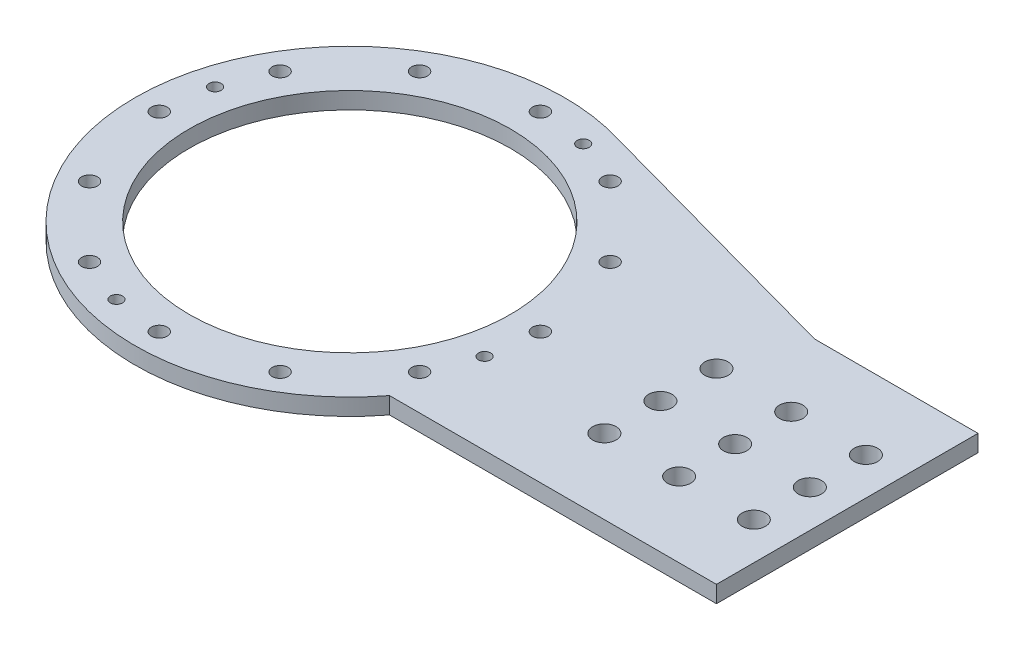
ISO-10303-21;
HEADER;
FILE_DESCRIPTION(('STEP AP214'),'2;1');
FILE_NAME('part.step','',(''),(''),'','','');
FILE_SCHEMA(('AUTOMOTIVE_DESIGN { 1 0 10303 214 1 1 1 1 }'));
ENDSEC;
DATA;
#1=APPLICATION_CONTEXT('core data for automotive mechanical design processes');
#2=APPLICATION_PROTOCOL_DEFINITION('international standard','automotive_design',2000,#1);
#3=PRODUCT_CONTEXT('',#1,'mechanical');
#4=PRODUCT('Part','Part','',(#3));
#5=PRODUCT_RELATED_PRODUCT_CATEGORY('part','',(#4));
#6=PRODUCT_DEFINITION_FORMATION('','',#4);
#7=PRODUCT_DEFINITION_CONTEXT('part definition',#1,'design');
#8=PRODUCT_DEFINITION('design','',#6,#7);
#9=PRODUCT_DEFINITION_SHAPE('','',#8);
#10=(LENGTH_UNIT() NAMED_UNIT(*) SI_UNIT(.MILLI.,.METRE.));
#11=(NAMED_UNIT(*) PLANE_ANGLE_UNIT() SI_UNIT($,.RADIAN.));
#12=(NAMED_UNIT(*) SI_UNIT($,.STERADIAN.) SOLID_ANGLE_UNIT());
#13=UNCERTAINTY_MEASURE_WITH_UNIT(LENGTH_MEASURE(1.E-05),#10,'distance_accuracy_value','');
#14=(GEOMETRIC_REPRESENTATION_CONTEXT(3) GLOBAL_UNCERTAINTY_ASSIGNED_CONTEXT((#13)) GLOBAL_UNIT_ASSIGNED_CONTEXT((#10,
#11,#12)) REPRESENTATION_CONTEXT('',''));
#15=CARTESIAN_POINT('',(0.,0.,0.));
#16=DIRECTION('',(0.,0.,1.));
#17=DIRECTION('',(1.,0.,0.));
#18=AXIS2_PLACEMENT_3D('',#15,#16,#17);
#19=CARTESIAN_POINT('',(83.1257980985413,-5.5,0.));
#20=DIRECTION('',(0.,1.,0.));
#21=DIRECTION('',(0.,0.,1.));
#22=AXIS2_PLACEMENT_3D('',#19,#20,#21);
#23=CYLINDRICAL_SURFACE('',#22,3.12500000000001);
#24=CARTESIAN_POINT('',(83.1257980985413,4.5,0.));
#25=DIRECTION('',(0.,1.,0.));
#26=DIRECTION('',(0.,0.,1.));
#27=AXIS2_PLACEMENT_3D('',#24,#25,#26);
#28=CIRCLE('',#27,3.12500000000001);
#29=CARTESIAN_POINT('',(83.1257980985413,4.5,3.12500000000001));
#30=VERTEX_POINT('',#29);
#31=EDGE_CURVE('E42',#30,#30,#28,.T.);
#32=ORIENTED_EDGE('',*,*,#31,.T.);
#33=EDGE_LOOP('',(#32));
#34=FACE_BOUND('',#33,.T.);
#35=CARTESIAN_POINT('',(83.1257980985413,0.,0.));
#36=DIRECTION('',(0.,1.,0.));
#37=DIRECTION('',(0.,0.,1.));
#38=AXIS2_PLACEMENT_3D('',#35,#36,#37);
#39=CIRCLE('',#38,3.12500000000001);
#40=CARTESIAN_POINT('',(83.1257980985413,0.,3.12500000000001));
#41=VERTEX_POINT('',#40);
#42=EDGE_CURVE('E11',#41,#41,#39,.T.);
#43=ORIENTED_EDGE('',*,*,#42,.F.);
#44=EDGE_LOOP('',(#43));
#45=FACE_BOUND('',#44,.T.);
#46=ADVANCED_FACE('F35',(#34,#45),#23,.F.);
#47=CARTESIAN_POINT('',(83.1257980985413,0.,15.));
#48=DIRECTION('',(0.,1.,0.));
#49=DIRECTION('',(0.,0.,1.));
#50=AXIS2_PLACEMENT_3D('',#47,#48,#49);
#51=CYLINDRICAL_SURFACE('',#50,3.125);
#52=CARTESIAN_POINT('',(83.1257980985413,0.,15.));
#53=DIRECTION('',(0.,1.,0.));
#54=DIRECTION('',(0.,0.,1.));
#55=AXIS2_PLACEMENT_3D('',#52,#53,#54);
#56=CIRCLE('',#55,3.125);
#57=CARTESIAN_POINT('',(83.1257980985413,0.,18.125));
#58=VERTEX_POINT('',#57);
#59=EDGE_CURVE('E122',#58,#58,#56,.T.);
#60=ORIENTED_EDGE('',*,*,#59,.F.);
#61=EDGE_LOOP('',(#60));
#62=FACE_BOUND('',#61,.T.);
#63=CARTESIAN_POINT('',(83.1257980985413,4.5,15.));
#64=DIRECTION('',(0.,1.,0.));
#65=DIRECTION('',(0.,0.,1.));
#66=AXIS2_PLACEMENT_3D('',#63,#64,#65);
#67=CIRCLE('',#66,3.125);
#68=CARTESIAN_POINT('',(83.1257980985413,4.5,18.125));
#69=VERTEX_POINT('',#68);
#70=EDGE_CURVE('E125',#69,#69,#67,.T.);
#71=ORIENTED_EDGE('',*,*,#70,.T.);
#72=EDGE_LOOP('',(#71));
#73=FACE_BOUND('',#72,.T.);
#74=ADVANCED_FACE('F193',(#62,#73),#51,.F.);
#75=CARTESIAN_POINT('',(83.1257980985413,0.,-15.));
#76=DIRECTION('',(0.,1.,0.));
#77=DIRECTION('',(0.,0.,1.));
#78=AXIS2_PLACEMENT_3D('',#75,#76,#77);
#79=CYLINDRICAL_SURFACE('',#78,3.125);
#80=CARTESIAN_POINT('',(83.1257980985413,0.,-15.));
#81=DIRECTION('',(0.,1.,0.));
#82=DIRECTION('',(0.,0.,1.));
#83=AXIS2_PLACEMENT_3D('',#80,#81,#82);
#84=CIRCLE('',#83,3.125);
#85=CARTESIAN_POINT('',(83.1257980985413,0.,-11.875));
#86=VERTEX_POINT('',#85);
#87=EDGE_CURVE('E115',#86,#86,#84,.T.);
#88=ORIENTED_EDGE('',*,*,#87,.F.);
#89=EDGE_LOOP('',(#88));
#90=FACE_BOUND('',#89,.T.);
#91=CARTESIAN_POINT('',(83.1257980985413,4.5,-15.));
#92=DIRECTION('',(0.,1.,0.));
#93=DIRECTION('',(0.,0.,1.));
#94=AXIS2_PLACEMENT_3D('',#91,#92,#93);
#95=CIRCLE('',#94,3.125);
#96=CARTESIAN_POINT('',(83.1257980985413,4.5,-11.875));
#97=VERTEX_POINT('',#96);
#98=EDGE_CURVE('E119',#97,#97,#95,.T.);
#99=ORIENTED_EDGE('',*,*,#98,.T.);
#100=EDGE_LOOP('',(#99));
#101=FACE_BOUND('',#100,.T.);
#102=ADVANCED_FACE('F197',(#90,#101),#79,.F.);
#103=CARTESIAN_POINT('',(0.,4.5,0.));
#104=DIRECTION('',(0.,-1.,0.));
#105=DIRECTION('',(0.,0.,-1.));
#106=AXIS2_PLACEMENT_3D('',#103,#104,#105);
#107=CYLINDRICAL_SURFACE('',#106,57.5);
#108=DIRECTION('',(0.,-1.,0.));
#109=VECTOR('',#108,1.);
#110=CARTESIAN_POINT('',(45.6207189772367,4.5,35.));
#111=LINE('',#110,#109);
#112=CARTESIAN_POINT('',(45.6207189772367,4.5,35.));
#113=VERTEX_POINT('',#112);
#114=CARTESIAN_POINT('',(45.6207189772367,0.,35.));
#115=VERTEX_POINT('',#114);
#116=EDGE_CURVE('E105',#113,#115,#111,.T.);
#117=ORIENTED_EDGE('',*,*,#116,.F.);
#118=CARTESIAN_POINT('',(0.,4.5,0.));
#119=DIRECTION('',(0.,1.,0.));
#120=DIRECTION('',(0.,0.,1.));
#121=AXIS2_PLACEMENT_3D('',#118,#119,#120);
#122=CIRCLE('',#121,57.5);
#123=CARTESIAN_POINT('',(16.7622892234834,4.5,-55.002505942805));
#124=VERTEX_POINT('',#123);
#125=EDGE_CURVE('E49',#124,#113,#122,.T.);
#126=ORIENTED_EDGE('',*,*,#125,.F.);
#127=DIRECTION('',(0.,-1.,0.));
#128=VECTOR('',#127,1.);
#129=CARTESIAN_POINT('',(16.7622892234842,4.5,-55.0025059428047));
#130=LINE('',#129,#128);
#131=CARTESIAN_POINT('',(16.7622892234834,0.,-55.002505942805));
#132=VERTEX_POINT('',#131);
#133=EDGE_CURVE('E53',#132,#124,#130,.F.);
#134=ORIENTED_EDGE('',*,*,#133,.F.);
#135=CARTESIAN_POINT('',(0.,0.,0.));
#136=DIRECTION('',(0.,1.,0.));
#137=DIRECTION('',(0.,0.,1.));
#138=AXIS2_PLACEMENT_3D('',#135,#136,#137);
#139=CIRCLE('',#138,57.5);
#140=EDGE_CURVE('E109',#132,#115,#139,.T.);
#141=ORIENTED_EDGE('',*,*,#140,.T.);
#142=EDGE_LOOP('',(#117,#126,#134,#141));
#143=FACE_BOUND('',#142,.T.);
#144=ADVANCED_FACE('F187',(#143),#107,.T.);
#145=CARTESIAN_POINT('',(133.125798098541,4.5,-35.));
#146=DIRECTION('',(0.,0.,1.));
#147=DIRECTION('',(1.,0.,0.));
#148=AXIS2_PLACEMENT_3D('',#145,#146,#147);
#149=PLANE('',#148);
#150=DIRECTION('',(0.,-1.,0.));
#151=VECTOR('',#150,1.);
#152=CARTESIAN_POINT('',(89.373258537889,4.5,-35.));
#153=LINE('',#152,#151);
#154=CARTESIAN_POINT('',(89.373258537889,4.5,-35.));
#155=VERTEX_POINT('',#154);
#156=CARTESIAN_POINT('',(89.373258537889,0.,-35.));
#157=VERTEX_POINT('',#156);
#158=EDGE_CURVE('E86',#155,#157,#153,.T.);
#159=ORIENTED_EDGE('',*,*,#158,.F.);
#160=DIRECTION('',(-1.,0.,0.));
#161=VECTOR('',#160,1.);
#162=CARTESIAN_POINT('',(133.125798098541,4.5,-35.));
#163=LINE('',#162,#161);
#164=CARTESIAN_POINT('',(133.125798098541,4.5,-35.));
#165=VERTEX_POINT('',#164);
#166=EDGE_CURVE('E79',#165,#155,#163,.T.);
#167=ORIENTED_EDGE('',*,*,#166,.F.);
#168=DIRECTION('',(0.,-1.,0.));
#169=VECTOR('',#168,1.);
#170=CARTESIAN_POINT('',(133.125798098541,4.5,-35.));
#171=LINE('',#170,#169);
#172=CARTESIAN_POINT('',(133.125798098541,0.,-35.));
#173=VERTEX_POINT('',#172);
#174=EDGE_CURVE('E83',#165,#173,#171,.T.);
#175=ORIENTED_EDGE('',*,*,#174,.T.);
#176=DIRECTION('',(-1.,0.,0.));
#177=VECTOR('',#176,1.);
#178=CARTESIAN_POINT('',(133.125798098541,0.,-35.));
#179=LINE('',#178,#177);
#180=EDGE_CURVE('E215',#173,#157,#179,.T.);
#181=ORIENTED_EDGE('',*,*,#180,.T.);
#182=EDGE_LOOP('',(#159,#167,#175,#181));
#183=FACE_BOUND('',#182,.T.);
#184=ADVANCED_FACE('F81',(#183),#149,.F.);
#185=CARTESIAN_POINT('',(0.,4.5,0.));
#186=DIRECTION('',(0.,1.,0.));
#187=DIRECTION('',(0.,0.,1.));
#188=AXIS2_PLACEMENT_3D('',#185,#186,#187);
#189=PLANE('',#188);
#190=CARTESIAN_POINT('',(103.125798098541,4.5,0.));
#191=DIRECTION('',(0.,1.,0.));
#192=DIRECTION('',(0.,0.,1.));
#193=AXIS2_PLACEMENT_3D('',#190,#191,#192);
#194=CIRCLE('',#193,3.12500000000001);
#195=CARTESIAN_POINT('',(103.125798098541,4.5,3.12500000000001));
#196=VERTEX_POINT('',#195);
#197=EDGE_CURVE('E320',#196,#196,#194,.T.);
#198=ORIENTED_EDGE('',*,*,#197,.F.);
#199=EDGE_LOOP('',(#198));
#200=FACE_BOUND('',#199,.T.);
#201=CARTESIAN_POINT('',(123.125798098541,4.5,0.));
#202=DIRECTION('',(0.,1.,0.));
#203=DIRECTION('',(0.,0.,1.));
#204=AXIS2_PLACEMENT_3D('',#201,#202,#203);
#205=CIRCLE('',#204,3.12500000000001);
#206=CARTESIAN_POINT('',(123.125798098541,4.5,3.12500000000001));
#207=VERTEX_POINT('',#206);
#208=EDGE_CURVE('E170',#207,#207,#205,.T.);
#209=ORIENTED_EDGE('',*,*,#208,.F.);
#210=EDGE_LOOP('',(#209));
#211=FACE_BOUND('',#210,.T.);
#212=CARTESIAN_POINT('',(-13.1997713002284,4.5,49.2622171407425));
#213=DIRECTION('',(0.,1.,0.));
#214=DIRECTION('',(1.,0.,0.));
#215=AXIS2_PLACEMENT_3D('',#212,#213,#214);
#216=CIRCLE('',#215,1.625);
#217=CARTESIAN_POINT('',(-11.5747713002284,4.5,49.2622171407425));
#218=VERTEX_POINT('',#217);
#219=EDGE_CURVE('E310',#218,#218,#216,.T.);
#220=ORIENTED_EDGE('',*,*,#219,.F.);
#221=EDGE_LOOP('',(#220));
#222=FACE_BOUND('',#221,.T.);
#223=CARTESIAN_POINT('',(49.2622171407425,4.5,13.1997713002286));
#224=DIRECTION('',(0.,1.,0.));
#225=DIRECTION('',(0.,0.,-1.));
#226=AXIS2_PLACEMENT_3D('',#223,#224,#225);
#227=CIRCLE('',#226,1.625);
#228=CARTESIAN_POINT('',(49.2622171407425,4.5,11.5747713002286));
#229=VERTEX_POINT('',#228);
#230=EDGE_CURVE('E304',#229,#229,#227,.T.);
#231=ORIENTED_EDGE('',*,*,#230,.F.);
#232=EDGE_LOOP('',(#231));
#233=FACE_BOUND('',#232,.T.);
#234=CARTESIAN_POINT('',(13.1997713002281,4.5,-49.2622171407426));
#235=DIRECTION('',(0.,1.,0.));
#236=DIRECTION('',(-1.,0.,0.));
#237=AXIS2_PLACEMENT_3D('',#234,#235,#236);
#238=CIRCLE('',#237,1.625);
#239=CARTESIAN_POINT('',(11.5747713002281,4.5,-49.2622171407426));
#240=VERTEX_POINT('',#239);
#241=EDGE_CURVE('E169',#240,#240,#238,.T.);
#242=ORIENTED_EDGE('',*,*,#241,.F.);
#243=EDGE_LOOP('',(#242));
#244=FACE_BOUND('',#243,.T.);
#245=CARTESIAN_POINT('',(-49.2622171407425,4.5,-13.1997713002286));
#246=DIRECTION('',(0.,1.,0.));
#247=DIRECTION('',(0.,0.,1.));
#248=AXIS2_PLACEMENT_3D('',#245,#246,#247);
#249=CIRCLE('',#248,1.625);
#250=CARTESIAN_POINT('',(-49.2622171407425,4.5,-11.5747713002286));
#251=VERTEX_POINT('',#250);
#252=EDGE_CURVE('E293',#251,#251,#249,.T.);
#253=ORIENTED_EDGE('',*,*,#252,.F.);
#254=EDGE_LOOP('',(#253));
#255=FACE_BOUND('',#254,.T.);
#256=CARTESIAN_POINT('',(-25.4999999999999,4.5,44.1672955930064));
#257=DIRECTION('',(0.,1.,0.));
#258=DIRECTION('',(0.86602540378444,0.,0.499999999999998));
#259=AXIS2_PLACEMENT_3D('',#256,#257,#258);
#260=CIRCLE('',#259,2.125);
#261=CARTESIAN_POINT('',(-23.659696016958,4.5,45.2297955930064));
#262=VERTEX_POINT('',#261);
#263=EDGE_CURVE('E262',#262,#262,#260,.T.);
#264=ORIENTED_EDGE('',*,*,#263,.F.);
#265=EDGE_LOOP('',(#264));
#266=FACE_BOUND('',#265,.T.);
#267=CARTESIAN_POINT('',(1.78065548281E-13,4.5,51.));
#268=DIRECTION('',(0.,1.,0.));
#269=DIRECTION('',(1.,0.,0.));
#270=AXIS2_PLACEMENT_3D('',#267,#268,#269);
#271=CIRCLE('',#270,2.125);
#272=CARTESIAN_POINT('',(2.12500000000018,4.5,51.));
#273=VERTEX_POINT('',#272);
#274=EDGE_CURVE('E282',#273,#273,#271,.T.);
#275=ORIENTED_EDGE('',*,*,#274,.F.);
#276=EDGE_LOOP('',(#275));
#277=FACE_BOUND('',#276,.T.);
#278=CARTESIAN_POINT('',(25.5000000000002,4.5,44.1672955930063));
#279=DIRECTION('',(0.,1.,0.));
#280=DIRECTION('',(0.866025403784436,0.,-0.500000000000004));
#281=AXIS2_PLACEMENT_3D('',#278,#279,#280);
#282=CIRCLE('',#281,2.125);
#283=CARTESIAN_POINT('',(27.3403039830421,4.5,43.1047955930063));
#284=VERTEX_POINT('',#283);
#285=EDGE_CURVE('E279',#284,#284,#282,.T.);
#286=ORIENTED_EDGE('',*,*,#285,.F.);
#287=EDGE_LOOP('',(#286));
#288=FACE_BOUND('',#287,.T.);
#289=CARTESIAN_POINT('',(44.1672955930065,4.5,25.4999999999997));
#290=DIRECTION('',(0.,1.,0.));
#291=DIRECTION('',(0.499999999999995,0.,-0.866025403784442));
#292=AXIS2_PLACEMENT_3D('',#289,#290,#291);
#293=CIRCLE('',#292,2.125);
#294=CARTESIAN_POINT('',(45.2297955930065,4.5,23.6596960169578));
#295=VERTEX_POINT('',#294);
#296=EDGE_CURVE('E276',#295,#295,#293,.T.);
#297=ORIENTED_EDGE('',*,*,#296,.F.);
#298=EDGE_LOOP('',(#297));
#299=FACE_BOUND('',#298,.T.);
#300=CARTESIAN_POINT('',(51.,4.5,0.));
#301=DIRECTION('',(0.,1.,0.));
#302=DIRECTION('',(0.,0.,-1.));
#303=AXIS2_PLACEMENT_3D('',#300,#301,#302);
#304=CIRCLE('',#303,2.125);
#305=CARTESIAN_POINT('',(51.,4.5,-2.125));
#306=VERTEX_POINT('',#305);
#307=EDGE_CURVE('E273',#306,#306,#304,.T.);
#308=ORIENTED_EDGE('',*,*,#307,.F.);
#309=EDGE_LOOP('',(#308));
#310=FACE_BOUND('',#309,.T.);
#311=CARTESIAN_POINT('',(44.1672955930062,4.5,-25.5000000000004));
#312=DIRECTION('',(0.,1.,0.));
#313=DIRECTION('',(-0.500000000000007,0.,-0.866025403784435));
#314=AXIS2_PLACEMENT_3D('',#311,#312,#313);
#315=CIRCLE('',#314,2.125);
#316=CARTESIAN_POINT('',(43.1047955930061,4.5,-27.3403039830423));
#317=VERTEX_POINT('',#316);
#318=EDGE_CURVE('E270',#317,#317,#315,.T.);
#319=ORIENTED_EDGE('',*,*,#318,.F.);
#320=EDGE_LOOP('',(#319));
#321=FACE_BOUND('',#320,.T.);
#322=CARTESIAN_POINT('',(25.4999999999996,4.5,-44.1672955930066));
#323=DIRECTION('',(0.,1.,0.));
#324=DIRECTION('',(-0.866025403784443,0.,-0.499999999999992));
#325=AXIS2_PLACEMENT_3D('',#322,#323,#324);
#326=CIRCLE('',#325,2.125);
#327=CARTESIAN_POINT('',(23.6596960169576,4.5,-45.2297955930066));
#328=VERTEX_POINT('',#327);
#329=EDGE_CURVE('E266',#328,#328,#326,.T.);
#330=ORIENTED_EDGE('',*,*,#329,.F.);
#331=EDGE_LOOP('',(#330));
#332=FACE_BOUND('',#331,.T.);
#333=CARTESIAN_POINT('',(-5.34196644842999E-13,4.5,-51.));
#334=DIRECTION('',(0.,1.,0.));
#335=DIRECTION('',(-1.,0.,0.));
#336=AXIS2_PLACEMENT_3D('',#333,#334,#335);
#337=CIRCLE('',#336,2.125);
#338=CARTESIAN_POINT('',(-2.12500000000054,4.5,-51.));
#339=VERTEX_POINT('',#338);
#340=EDGE_CURVE('E263',#339,#339,#337,.T.);
#341=ORIENTED_EDGE('',*,*,#340,.F.);
#342=EDGE_LOOP('',(#341));
#343=FACE_BOUND('',#342,.T.);
#344=CARTESIAN_POINT('',(-25.5000000000005,4.5,-44.1672955930061));
#345=DIRECTION('',(0.,1.,0.));
#346=DIRECTION('',(-0.866025403784433,0.,0.50000000000001));
#347=AXIS2_PLACEMENT_3D('',#344,#345,#346);
#348=CIRCLE('',#347,2.125);
#349=CARTESIAN_POINT('',(-27.3403039830424,4.5,-43.104795593006));
#350=VERTEX_POINT('',#349);
#351=EDGE_CURVE('E267',#350,#350,#348,.T.);
#352=ORIENTED_EDGE('',*,*,#351,.F.);
#353=EDGE_LOOP('',(#352));
#354=FACE_BOUND('',#353,.T.);
#355=CARTESIAN_POINT('',(-44.1672955930067,4.5,-25.4999999999994));
#356=DIRECTION('',(0.,1.,0.));
#357=DIRECTION('',(-0.499999999999989,0.,0.866025403784445));
#358=AXIS2_PLACEMENT_3D('',#355,#356,#357);
#359=CIRCLE('',#358,2.125);
#360=CARTESIAN_POINT('',(-45.2297955930067,4.5,-23.6596960169575));
#361=VERTEX_POINT('',#360);
#362=EDGE_CURVE('E287',#361,#361,#359,.T.);
#363=ORIENTED_EDGE('',*,*,#362,.F.);
#364=EDGE_LOOP('',(#363));
#365=FACE_BOUND('',#364,.T.);
#366=CARTESIAN_POINT('',(-44.1672955930063,4.5,25.5));
#367=DIRECTION('',(0.,1.,0.));
#368=DIRECTION('',(0.500000000000001,0.,0.866025403784438));
#369=AXIS2_PLACEMENT_3D('',#366,#367,#368);
#370=CIRCLE('',#369,2.125);
#371=CARTESIAN_POINT('',(-43.1047955930063,4.5,27.340303983042));
#372=VERTEX_POINT('',#371);
#373=EDGE_CURVE('E137',#372,#372,#370,.T.);
#374=ORIENTED_EDGE('',*,*,#373,.F.);
#375=EDGE_LOOP('',(#374));
#376=FACE_BOUND('',#375,.T.);
#377=CARTESIAN_POINT('',(-51.,4.5,0.));
#378=DIRECTION('',(0.,1.,0.));
#379=DIRECTION('',(0.,0.,1.));
#380=AXIS2_PLACEMENT_3D('',#377,#378,#379);
#381=CIRCLE('',#380,2.125);
#382=CARTESIAN_POINT('',(-51.,4.5,2.125));
#383=VERTEX_POINT('',#382);
#384=EDGE_CURVE('E132',#383,#383,#381,.T.);
#385=ORIENTED_EDGE('',*,*,#384,.F.);
#386=EDGE_LOOP('',(#385));
#387=FACE_BOUND('',#386,.T.);
#388=CARTESIAN_POINT('',(103.125798098541,4.5,15.));
#389=DIRECTION('',(0.,1.,0.));
#390=DIRECTION('',(0.,0.,1.));
#391=AXIS2_PLACEMENT_3D('',#388,#389,#390);
#392=CIRCLE('',#391,3.125);
#393=CARTESIAN_POINT('',(103.125798098541,4.5,18.125));
#394=VERTEX_POINT('',#393);
#395=EDGE_CURVE('E253',#394,#394,#392,.T.);
#396=ORIENTED_EDGE('',*,*,#395,.F.);
#397=EDGE_LOOP('',(#396));
#398=FACE_BOUND('',#397,.T.);
#399=CARTESIAN_POINT('',(103.125798098541,4.5,-15.));
#400=DIRECTION('',(0.,1.,0.));
#401=DIRECTION('',(0.,0.,1.));
#402=AXIS2_PLACEMENT_3D('',#399,#400,#401);
#403=CIRCLE('',#402,3.125);
#404=CARTESIAN_POINT('',(103.125798098541,4.5,-11.875));
#405=VERTEX_POINT('',#404);
#406=EDGE_CURVE('E240',#405,#405,#403,.T.);
#407=ORIENTED_EDGE('',*,*,#406,.F.);
#408=EDGE_LOOP('',(#407));
#409=FACE_BOUND('',#408,.T.);
#410=CARTESIAN_POINT('',(123.125798098541,4.5,-15.));
#411=DIRECTION('',(0.,1.,0.));
#412=DIRECTION('',(0.,0.,1.));
#413=AXIS2_PLACEMENT_3D('',#410,#411,#412);
#414=CIRCLE('',#413,3.125);
#415=CARTESIAN_POINT('',(123.125798098541,4.5,-11.875));
#416=VERTEX_POINT('',#415);
#417=EDGE_CURVE('E243',#416,#416,#414,.T.);
#418=ORIENTED_EDGE('',*,*,#417,.F.);
#419=EDGE_LOOP('',(#418));
#420=FACE_BOUND('',#419,.T.);
#421=CARTESIAN_POINT('',(123.125798098541,4.5,15.));
#422=DIRECTION('',(0.,1.,0.));
#423=DIRECTION('',(0.,0.,1.));
#424=AXIS2_PLACEMENT_3D('',#421,#422,#423);
#425=CIRCLE('',#424,3.125);
#426=CARTESIAN_POINT('',(123.125798098541,4.5,18.125));
#427=VERTEX_POINT('',#426);
#428=EDGE_CURVE('E236',#427,#427,#425,.T.);
#429=ORIENTED_EDGE('',*,*,#428,.F.);
#430=EDGE_LOOP('',(#429));
#431=FACE_BOUND('',#430,.T.);
#432=CARTESIAN_POINT('',(0.,4.5,0.));
#433=DIRECTION('',(0.,1.,0.));
#434=DIRECTION('',(0.,0.,1.));
#435=AXIS2_PLACEMENT_3D('',#432,#433,#434);
#436=CIRCLE('',#435,43.);
#437=CARTESIAN_POINT('',(0.,4.5,43.));
#438=VERTEX_POINT('',#437);
#439=EDGE_CURVE('E230',#438,#438,#436,.T.);
#440=ORIENTED_EDGE('',*,*,#439,.F.);
#441=EDGE_LOOP('',(#440));
#442=FACE_BOUND('',#441,.T.);
#443=DIRECTION('',(-0.964088221769249,0.,-0.265582191883806));
#444=VECTOR('',#443,1.);
#445=CARTESIAN_POINT('',(89.373258537889,4.5,-35.));
#446=LINE('',#445,#444);
#447=EDGE_CURVE('E222',#155,#124,#446,.T.);
#448=ORIENTED_EDGE('',*,*,#447,.T.);
#449=ORIENTED_EDGE('',*,*,#125,.T.);
#450=DIRECTION('',(1.,0.,0.));
#451=VECTOR('',#450,1.);
#452=CARTESIAN_POINT('',(133.125798098541,4.5,35.));
#453=LINE('',#452,#451);
#454=CARTESIAN_POINT('',(133.125798098541,4.5,35.));
#455=VERTEX_POINT('',#454);
#456=EDGE_CURVE('E90',#113,#455,#453,.T.);
#457=ORIENTED_EDGE('',*,*,#456,.T.);
#458=DIRECTION('',(0.,0.,-1.));
#459=VECTOR('',#458,1.);
#460=CARTESIAN_POINT('',(133.125798098541,4.5,-35.));
#461=LINE('',#460,#459);
#462=EDGE_CURVE('E91',#455,#165,#461,.T.);
#463=ORIENTED_EDGE('',*,*,#462,.T.);
#464=ORIENTED_EDGE('',*,*,#166,.T.);
#465=EDGE_LOOP('',(#448,#449,#457,#463,#464));
#466=FACE_BOUND('',#465,.T.);
#467=ORIENTED_EDGE('',*,*,#98,.F.);
#468=EDGE_LOOP('',(#467));
#469=FACE_BOUND('',#468,.T.);
#470=ORIENTED_EDGE('',*,*,#70,.F.);
#471=EDGE_LOOP('',(#470));
#472=FACE_BOUND('',#471,.T.);
#473=ORIENTED_EDGE('',*,*,#31,.F.);
#474=EDGE_LOOP('',(#473));
#475=FACE_BOUND('',#474,.T.);
#476=ADVANCED_FACE('F94',(#200,#211,#222,#233,#244,#255,#266,#277,#288,#299,#310,#321,#332,#343,
#354,#365,#376,#387,#398,#409,#420,#431,#442,#466,#469,#472,#475),#189,.T.);
#477=CARTESIAN_POINT('',(0.,0.,0.));
#478=DIRECTION('',(0.,1.,0.));
#479=DIRECTION('',(0.,0.,1.));
#480=AXIS2_PLACEMENT_3D('',#477,#478,#479);
#481=PLANE('',#480);
#482=CARTESIAN_POINT('',(103.125798098541,0.,0.));
#483=DIRECTION('',(0.,1.,0.));
#484=DIRECTION('',(0.,0.,1.));
#485=AXIS2_PLACEMENT_3D('',#482,#483,#484);
#486=CIRCLE('',#485,3.12500000000001);
#487=CARTESIAN_POINT('',(103.125798098541,0.,3.12500000000001));
#488=VERTEX_POINT('',#487);
#489=EDGE_CURVE('E317',#488,#488,#486,.T.);
#490=ORIENTED_EDGE('',*,*,#489,.T.);
#491=EDGE_LOOP('',(#490));
#492=FACE_BOUND('',#491,.T.);
#493=CARTESIAN_POINT('',(123.125798098541,0.,0.));
#494=DIRECTION('',(0.,1.,0.));
#495=DIRECTION('',(0.,0.,1.));
#496=AXIS2_PLACEMENT_3D('',#493,#494,#495);
#497=CIRCLE('',#496,3.12500000000001);
#498=CARTESIAN_POINT('',(123.125798098541,0.,3.12500000000001));
#499=VERTEX_POINT('',#498);
#500=EDGE_CURVE('E167',#499,#499,#497,.T.);
#501=ORIENTED_EDGE('',*,*,#500,.T.);
#502=EDGE_LOOP('',(#501));
#503=FACE_BOUND('',#502,.T.);
#504=CARTESIAN_POINT('',(-13.1997713002284,0.,49.2622171407425));
#505=DIRECTION('',(0.,1.,0.));
#506=DIRECTION('',(1.,0.,0.));
#507=AXIS2_PLACEMENT_3D('',#504,#505,#506);
#508=CIRCLE('',#507,1.625);
#509=CARTESIAN_POINT('',(-11.5747713002284,0.,49.2622171407425));
#510=VERTEX_POINT('',#509);
#511=EDGE_CURVE('E296',#510,#510,#508,.T.);
#512=ORIENTED_EDGE('',*,*,#511,.T.);
#513=EDGE_LOOP('',(#512));
#514=FACE_BOUND('',#513,.T.);
#515=CARTESIAN_POINT('',(49.2622171407425,0.,13.1997713002286));
#516=DIRECTION('',(0.,1.,0.));
#517=DIRECTION('',(0.,0.,-1.));
#518=AXIS2_PLACEMENT_3D('',#515,#516,#517);
#519=CIRCLE('',#518,1.625);
#520=CARTESIAN_POINT('',(49.2622171407425,0.,11.5747713002286));
#521=VERTEX_POINT('',#520);
#522=EDGE_CURVE('E307',#521,#521,#519,.T.);
#523=ORIENTED_EDGE('',*,*,#522,.T.);
#524=EDGE_LOOP('',(#523));
#525=FACE_BOUND('',#524,.T.);
#526=CARTESIAN_POINT('',(13.1997713002281,0.,-49.2622171407426));
#527=DIRECTION('',(0.,1.,0.));
#528=DIRECTION('',(-1.,0.,0.));
#529=AXIS2_PLACEMENT_3D('',#526,#527,#528);
#530=CIRCLE('',#529,1.625);
#531=CARTESIAN_POINT('',(11.5747713002281,0.,-49.2622171407426));
#532=VERTEX_POINT('',#531);
#533=EDGE_CURVE('E301',#532,#532,#530,.T.);
#534=ORIENTED_EDGE('',*,*,#533,.T.);
#535=EDGE_LOOP('',(#534));
#536=FACE_BOUND('',#535,.T.);
#537=CARTESIAN_POINT('',(-49.2622171407425,0.,-13.1997713002286));
#538=DIRECTION('',(0.,1.,0.));
#539=DIRECTION('',(0.,0.,1.));
#540=AXIS2_PLACEMENT_3D('',#537,#538,#539);
#541=CIRCLE('',#540,1.625);
#542=CARTESIAN_POINT('',(-49.2622171407425,0.,-11.5747713002286));
#543=VERTEX_POINT('',#542);
#544=EDGE_CURVE('E290',#543,#543,#541,.T.);
#545=ORIENTED_EDGE('',*,*,#544,.T.);
#546=EDGE_LOOP('',(#545));
#547=FACE_BOUND('',#546,.T.);
#548=CARTESIAN_POINT('',(-25.4999999999999,0.,44.1672955930064));
#549=DIRECTION('',(0.,1.,0.));
#550=DIRECTION('',(0.,0.,1.));
#551=AXIS2_PLACEMENT_3D('',#548,#549,#550);
#552=CIRCLE('',#551,2.125);
#553=CARTESIAN_POINT('',(-25.4999999999999,0.,46.2922955930064));
#554=VERTEX_POINT('',#553);
#555=EDGE_CURVE('E164',#554,#554,#552,.T.);
#556=ORIENTED_EDGE('',*,*,#555,.T.);
#557=EDGE_LOOP('',(#556));
#558=FACE_BOUND('',#557,.T.);
#559=CARTESIAN_POINT('',(1.78065548281E-13,0.,51.));
#560=DIRECTION('',(0.,1.,0.));
#561=DIRECTION('',(0.,0.,1.));
#562=AXIS2_PLACEMENT_3D('',#559,#560,#561);
#563=CIRCLE('',#562,2.125);
#564=CARTESIAN_POINT('',(1.78065548281E-13,0.,53.125));
#565=VERTEX_POINT('',#564);
#566=EDGE_CURVE('E161',#565,#565,#563,.T.);
#567=ORIENTED_EDGE('',*,*,#566,.T.);
#568=EDGE_LOOP('',(#567));
#569=FACE_BOUND('',#568,.T.);
#570=CARTESIAN_POINT('',(25.5000000000002,0.,44.1672955930063));
#571=DIRECTION('',(0.,1.,0.));
#572=DIRECTION('',(0.,0.,1.));
#573=AXIS2_PLACEMENT_3D('',#570,#571,#572);
#574=CIRCLE('',#573,2.125);
#575=CARTESIAN_POINT('',(25.5000000000002,0.,46.2922955930063));
#576=VERTEX_POINT('',#575);
#577=EDGE_CURVE('E158',#576,#576,#574,.T.);
#578=ORIENTED_EDGE('',*,*,#577,.T.);
#579=EDGE_LOOP('',(#578));
#580=FACE_BOUND('',#579,.T.);
#581=CARTESIAN_POINT('',(44.1672955930065,0.,25.4999999999997));
#582=DIRECTION('',(0.,1.,0.));
#583=DIRECTION('',(0.,0.,1.));
#584=AXIS2_PLACEMENT_3D('',#581,#582,#583);
#585=CIRCLE('',#584,2.125);
#586=CARTESIAN_POINT('',(44.1672955930065,0.,27.6249999999997));
#587=VERTEX_POINT('',#586);
#588=EDGE_CURVE('E155',#587,#587,#585,.T.);
#589=ORIENTED_EDGE('',*,*,#588,.T.);
#590=EDGE_LOOP('',(#589));
#591=FACE_BOUND('',#590,.T.);
#592=CARTESIAN_POINT('',(51.,0.,0.));
#593=DIRECTION('',(0.,1.,0.));
#594=DIRECTION('',(0.,0.,1.));
#595=AXIS2_PLACEMENT_3D('',#592,#593,#594);
#596=CIRCLE('',#595,2.125);
#597=CARTESIAN_POINT('',(51.,0.,2.125));
#598=VERTEX_POINT('',#597);
#599=EDGE_CURVE('E152',#598,#598,#596,.T.);
#600=ORIENTED_EDGE('',*,*,#599,.T.);
#601=EDGE_LOOP('',(#600));
#602=FACE_BOUND('',#601,.T.);
#603=CARTESIAN_POINT('',(44.1672955930062,0.,-25.5000000000004));
#604=DIRECTION('',(0.,1.,0.));
#605=DIRECTION('',(0.,0.,1.));
#606=AXIS2_PLACEMENT_3D('',#603,#604,#605);
#607=CIRCLE('',#606,2.125);
#608=CARTESIAN_POINT('',(44.1672955930062,0.,-23.3750000000004));
#609=VERTEX_POINT('',#608);
#610=EDGE_CURVE('E149',#609,#609,#607,.T.);
#611=ORIENTED_EDGE('',*,*,#610,.T.);
#612=EDGE_LOOP('',(#611));
#613=FACE_BOUND('',#612,.T.);
#614=CARTESIAN_POINT('',(25.4999999999996,0.,-44.1672955930066));
#615=DIRECTION('',(0.,1.,0.));
#616=DIRECTION('',(0.,0.,1.));
#617=AXIS2_PLACEMENT_3D('',#614,#615,#616);
#618=CIRCLE('',#617,2.125);
#619=CARTESIAN_POINT('',(25.4999999999996,0.,-42.0422955930066));
#620=VERTEX_POINT('',#619);
#621=EDGE_CURVE('E146',#620,#620,#618,.T.);
#622=ORIENTED_EDGE('',*,*,#621,.T.);
#623=EDGE_LOOP('',(#622));
#624=FACE_BOUND('',#623,.T.);
#625=CARTESIAN_POINT('',(-5.34196644842999E-13,0.,-51.));
#626=DIRECTION('',(0.,1.,0.));
#627=DIRECTION('',(0.,0.,1.));
#628=AXIS2_PLACEMENT_3D('',#625,#626,#627);
#629=CIRCLE('',#628,2.125);
#630=CARTESIAN_POINT('',(-5.34196644842999E-13,0.,-48.875));
#631=VERTEX_POINT('',#630);
#632=EDGE_CURVE('E143',#631,#631,#629,.T.);
#633=ORIENTED_EDGE('',*,*,#632,.T.);
#634=EDGE_LOOP('',(#633));
#635=FACE_BOUND('',#634,.T.);
#636=CARTESIAN_POINT('',(-25.5000000000005,0.,-44.1672955930061));
#637=DIRECTION('',(0.,1.,0.));
#638=DIRECTION('',(0.,0.,1.));
#639=AXIS2_PLACEMENT_3D('',#636,#637,#638);
#640=CIRCLE('',#639,2.125);
#641=CARTESIAN_POINT('',(-25.5000000000005,0.,-42.0422955930061));
#642=VERTEX_POINT('',#641);
#643=EDGE_CURVE('E140',#642,#642,#640,.T.);
#644=ORIENTED_EDGE('',*,*,#643,.T.);
#645=EDGE_LOOP('',(#644));
#646=FACE_BOUND('',#645,.T.);
#647=CARTESIAN_POINT('',(-44.1672955930067,0.,-25.4999999999994));
#648=DIRECTION('',(0.,1.,0.));
#649=DIRECTION('',(0.,0.,1.));
#650=AXIS2_PLACEMENT_3D('',#647,#648,#649);
#651=CIRCLE('',#650,2.125);
#652=CARTESIAN_POINT('',(-44.1672955930067,0.,-23.3749999999994));
#653=VERTEX_POINT('',#652);
#654=EDGE_CURVE('E136',#653,#653,#651,.T.);
#655=ORIENTED_EDGE('',*,*,#654,.T.);
#656=EDGE_LOOP('',(#655));
#657=FACE_BOUND('',#656,.T.);
#658=CARTESIAN_POINT('',(-44.1672955930063,0.,25.5));
#659=DIRECTION('',(0.,1.,0.));
#660=DIRECTION('',(0.,0.,1.));
#661=AXIS2_PLACEMENT_3D('',#658,#659,#660);
#662=CIRCLE('',#661,2.125);
#663=CARTESIAN_POINT('',(-44.1672955930063,0.,27.6250000000001));
#664=VERTEX_POINT('',#663);
#665=EDGE_CURVE('E133',#664,#664,#662,.T.);
#666=ORIENTED_EDGE('',*,*,#665,.T.);
#667=EDGE_LOOP('',(#666));
#668=FACE_BOUND('',#667,.T.);
#669=CARTESIAN_POINT('',(-51.,0.,0.));
#670=DIRECTION('',(0.,1.,0.));
#671=DIRECTION('',(0.,0.,1.));
#672=AXIS2_PLACEMENT_3D('',#669,#670,#671);
#673=CIRCLE('',#672,2.125);
#674=CARTESIAN_POINT('',(-51.,0.,2.125));
#675=VERTEX_POINT('',#674);
#676=EDGE_CURVE('E128',#675,#675,#673,.T.);
#677=ORIENTED_EDGE('',*,*,#676,.T.);
#678=EDGE_LOOP('',(#677));
#679=FACE_BOUND('',#678,.T.);
#680=CARTESIAN_POINT('',(103.125798098541,0.,15.));
#681=DIRECTION('',(0.,1.,0.));
#682=DIRECTION('',(0.,0.,1.));
#683=AXIS2_PLACEMENT_3D('',#680,#681,#682);
#684=CIRCLE('',#683,3.125);
#685=CARTESIAN_POINT('',(103.125798098541,0.,18.125));
#686=VERTEX_POINT('',#685);
#687=EDGE_CURVE('E131',#686,#686,#684,.T.);
#688=ORIENTED_EDGE('',*,*,#687,.T.);
#689=EDGE_LOOP('',(#688));
#690=FACE_BOUND('',#689,.T.);
#691=CARTESIAN_POINT('',(103.125798098541,0.,-15.));
#692=DIRECTION('',(0.,1.,0.));
#693=DIRECTION('',(0.,0.,1.));
#694=AXIS2_PLACEMENT_3D('',#691,#692,#693);
#695=CIRCLE('',#694,3.125);
#696=CARTESIAN_POINT('',(103.125798098541,0.,-11.875));
#697=VERTEX_POINT('',#696);
#698=EDGE_CURVE('E250',#697,#697,#695,.T.);
#699=ORIENTED_EDGE('',*,*,#698,.T.);
#700=EDGE_LOOP('',(#699));
#701=FACE_BOUND('',#700,.T.);
#702=CARTESIAN_POINT('',(123.125798098541,0.,-15.));
#703=DIRECTION('',(0.,1.,0.));
#704=DIRECTION('',(0.,0.,1.));
#705=AXIS2_PLACEMENT_3D('',#702,#703,#704);
#706=CIRCLE('',#705,3.125);
#707=CARTESIAN_POINT('',(123.125798098541,0.,-11.875));
#708=VERTEX_POINT('',#707);
#709=EDGE_CURVE('E233',#708,#708,#706,.T.);
#710=ORIENTED_EDGE('',*,*,#709,.T.);
#711=EDGE_LOOP('',(#710));
#712=FACE_BOUND('',#711,.T.);
#713=CARTESIAN_POINT('',(123.125798098541,0.,15.));
#714=DIRECTION('',(0.,1.,0.));
#715=DIRECTION('',(0.,0.,1.));
#716=AXIS2_PLACEMENT_3D('',#713,#714,#715);
#717=CIRCLE('',#716,3.125);
#718=CARTESIAN_POINT('',(123.125798098541,0.,18.125));
#719=VERTEX_POINT('',#718);
#720=EDGE_CURVE('E239',#719,#719,#717,.T.);
#721=ORIENTED_EDGE('',*,*,#720,.T.);
#722=EDGE_LOOP('',(#721));
#723=FACE_BOUND('',#722,.T.);
#724=CARTESIAN_POINT('',(0.,0.,0.));
#725=DIRECTION('',(0.,1.,0.));
#726=DIRECTION('',(0.,0.,1.));
#727=AXIS2_PLACEMENT_3D('',#724,#725,#726);
#728=CIRCLE('',#727,43.);
#729=CARTESIAN_POINT('',(0.,0.,43.));
#730=VERTEX_POINT('',#729);
#731=EDGE_CURVE('E223',#730,#730,#728,.T.);
#732=ORIENTED_EDGE('',*,*,#731,.T.);
#733=EDGE_LOOP('',(#732));
#734=FACE_BOUND('',#733,.T.);
#735=ORIENTED_EDGE('',*,*,#140,.F.);
#736=DIRECTION('',(-0.964088221769249,0.,-0.265582191883806));
#737=VECTOR('',#736,1.);
#738=CARTESIAN_POINT('',(89.373258537889,0.,-35.));
#739=LINE('',#738,#737);
#740=EDGE_CURVE('E220',#157,#132,#739,.T.);
#741=ORIENTED_EDGE('',*,*,#740,.F.);
#742=ORIENTED_EDGE('',*,*,#180,.F.);
#743=DIRECTION('',(0.,0.,-1.));
#744=VECTOR('',#743,1.);
#745=CARTESIAN_POINT('',(133.125798098541,0.,-35.));
#746=LINE('',#745,#744);
#747=CARTESIAN_POINT('',(133.125798098541,0.,35.));
#748=VERTEX_POINT('',#747);
#749=EDGE_CURVE('E104',#748,#173,#746,.T.);
#750=ORIENTED_EDGE('',*,*,#749,.F.);
#751=DIRECTION('',(1.,0.,0.));
#752=VECTOR('',#751,1.);
#753=CARTESIAN_POINT('',(133.125798098541,0.,35.));
#754=LINE('',#753,#752);
#755=EDGE_CURVE('E100',#115,#748,#754,.T.);
#756=ORIENTED_EDGE('',*,*,#755,.F.);
#757=EDGE_LOOP('',(#735,#741,#742,#750,#756));
#758=FACE_BOUND('',#757,.T.);
#759=ORIENTED_EDGE('',*,*,#87,.T.);
#760=EDGE_LOOP('',(#759));
#761=FACE_BOUND('',#760,.T.);
#762=ORIENTED_EDGE('',*,*,#59,.T.);
#763=EDGE_LOOP('',(#762));
#764=FACE_BOUND('',#763,.T.);
#765=ORIENTED_EDGE('',*,*,#42,.T.);
#766=EDGE_LOOP('',(#765));
#767=FACE_BOUND('',#766,.T.);
#768=ADVANCED_FACE('F177',(#492,#503,#514,#525,#536,#547,#558,#569,#580,#591,#602,#613,#624,
#635,#646,#657,#668,#679,#690,#701,#712,#723,#734,#758,#761,#764,#767),#481,.F.);
#769=CARTESIAN_POINT('',(133.125798098541,4.5,35.));
#770=DIRECTION('',(0.,0.,-1.));
#771=DIRECTION('',(-1.,0.,0.));
#772=AXIS2_PLACEMENT_3D('',#769,#770,#771);
#773=PLANE('',#772);
#774=ORIENTED_EDGE('',*,*,#456,.F.);
#775=ORIENTED_EDGE('',*,*,#116,.T.);
#776=ORIENTED_EDGE('',*,*,#755,.T.);
#777=DIRECTION('',(0.,-1.,0.));
#778=VECTOR('',#777,1.);
#779=CARTESIAN_POINT('',(133.125798098541,4.5,35.));
#780=LINE('',#779,#778);
#781=EDGE_CURVE('E106',#455,#748,#780,.T.);
#782=ORIENTED_EDGE('',*,*,#781,.F.);
#783=EDGE_LOOP('',(#774,#775,#776,#782));
#784=FACE_BOUND('',#783,.T.);
#785=ADVANCED_FACE('F184',(#784),#773,.F.);
#786=CARTESIAN_POINT('',(133.125798098541,4.5,-35.));
#787=DIRECTION('',(-1.,0.,0.));
#788=DIRECTION('',(0.,0.,1.));
#789=AXIS2_PLACEMENT_3D('',#786,#787,#788);
#790=PLANE('',#789);
#791=ORIENTED_EDGE('',*,*,#749,.T.);
#792=ORIENTED_EDGE('',*,*,#174,.F.);
#793=ORIENTED_EDGE('',*,*,#462,.F.);
#794=ORIENTED_EDGE('',*,*,#781,.T.);
#795=EDGE_LOOP('',(#791,#792,#793,#794));
#796=FACE_BOUND('',#795,.T.);
#797=ADVANCED_FACE('F102',(#796),#790,.F.);
#798=CARTESIAN_POINT('',(89.373258537889,4.5,-35.));
#799=DIRECTION('',(-0.265582191883806,0.,0.964088221769249));
#800=DIRECTION('',(0.964088221769249,0.,0.265582191883806));
#801=AXIS2_PLACEMENT_3D('',#798,#799,#800);
#802=PLANE('',#801);
#803=ORIENTED_EDGE('',*,*,#740,.T.);
#804=ORIENTED_EDGE('',*,*,#133,.T.);
#805=ORIENTED_EDGE('',*,*,#447,.F.);
#806=ORIENTED_EDGE('',*,*,#158,.T.);
#807=EDGE_LOOP('',(#803,#804,#805,#806));
#808=FACE_BOUND('',#807,.T.);
#809=ADVANCED_FACE('F225',(#808),#802,.F.);
#810=CARTESIAN_POINT('',(0.,0.,0.));
#811=DIRECTION('',(0.,1.,0.));
#812=DIRECTION('',(0.,0.,1.));
#813=AXIS2_PLACEMENT_3D('',#810,#811,#812);
#814=CYLINDRICAL_SURFACE('',#813,43.);
#815=ORIENTED_EDGE('',*,*,#731,.F.);
#816=EDGE_LOOP('',(#815));
#817=FACE_BOUND('',#816,.T.);
#818=ORIENTED_EDGE('',*,*,#439,.T.);
#819=EDGE_LOOP('',(#818));
#820=FACE_BOUND('',#819,.T.);
#821=ADVANCED_FACE('F374',(#817,#820),#814,.F.);
#822=CARTESIAN_POINT('',(123.125798098541,0.,15.));
#823=DIRECTION('',(0.,1.,0.));
#824=DIRECTION('',(0.,0.,1.));
#825=AXIS2_PLACEMENT_3D('',#822,#823,#824);
#826=CYLINDRICAL_SURFACE('',#825,3.125);
#827=ORIENTED_EDGE('',*,*,#720,.F.);
#828=EDGE_LOOP('',(#827));
#829=FACE_BOUND('',#828,.T.);
#830=ORIENTED_EDGE('',*,*,#428,.T.);
#831=EDGE_LOOP('',(#830));
#832=FACE_BOUND('',#831,.T.);
#833=ADVANCED_FACE('F377',(#829,#832),#826,.F.);
#834=CARTESIAN_POINT('',(123.125798098541,0.,-15.));
#835=DIRECTION('',(0.,1.,0.));
#836=DIRECTION('',(0.,0.,1.));
#837=AXIS2_PLACEMENT_3D('',#834,#835,#836);
#838=CYLINDRICAL_SURFACE('',#837,3.125);
#839=ORIENTED_EDGE('',*,*,#709,.F.);
#840=EDGE_LOOP('',(#839));
#841=FACE_BOUND('',#840,.T.);
#842=ORIENTED_EDGE('',*,*,#417,.T.);
#843=EDGE_LOOP('',(#842));
#844=FACE_BOUND('',#843,.T.);
#845=ADVANCED_FACE('F385',(#841,#844),#838,.F.);
#846=CARTESIAN_POINT('',(103.125798098541,0.,-15.));
#847=DIRECTION('',(0.,1.,0.));
#848=DIRECTION('',(0.,0.,1.));
#849=AXIS2_PLACEMENT_3D('',#846,#847,#848);
#850=CYLINDRICAL_SURFACE('',#849,3.125);
#851=ORIENTED_EDGE('',*,*,#698,.F.);
#852=EDGE_LOOP('',(#851));
#853=FACE_BOUND('',#852,.T.);
#854=ORIENTED_EDGE('',*,*,#406,.T.);
#855=EDGE_LOOP('',(#854));
#856=FACE_BOUND('',#855,.T.);
#857=ADVANCED_FACE('F423',(#853,#856),#850,.F.);
#858=CARTESIAN_POINT('',(103.125798098541,0.,15.));
#859=DIRECTION('',(0.,1.,0.));
#860=DIRECTION('',(0.,0.,1.));
#861=AXIS2_PLACEMENT_3D('',#858,#859,#860);
#862=CYLINDRICAL_SURFACE('',#861,3.125);
#863=ORIENTED_EDGE('',*,*,#687,.F.);
#864=EDGE_LOOP('',(#863));
#865=FACE_BOUND('',#864,.T.);
#866=ORIENTED_EDGE('',*,*,#395,.T.);
#867=EDGE_LOOP('',(#866));
#868=FACE_BOUND('',#867,.T.);
#869=ADVANCED_FACE('F443',(#865,#868),#862,.F.);
#870=CARTESIAN_POINT('',(-51.,-1.2E-05,0.));
#871=DIRECTION('',(0.,1.,0.));
#872=DIRECTION('',(0.,0.,1.));
#873=AXIS2_PLACEMENT_3D('',#870,#871,#872);
#874=CYLINDRICAL_SURFACE('',#873,2.125);
#875=ORIENTED_EDGE('',*,*,#384,.T.);
#876=EDGE_LOOP('',(#875));
#877=FACE_BOUND('',#876,.T.);
#878=ORIENTED_EDGE('',*,*,#676,.F.);
#879=EDGE_LOOP('',(#878));
#880=FACE_BOUND('',#879,.T.);
#881=ADVANCED_FACE('F453',(#877,#880),#874,.F.);
#882=CARTESIAN_POINT('',(-44.1672955930063,-1.2E-05,25.5));
#883=DIRECTION('',(0.,1.,0.));
#884=DIRECTION('',(0.,0.,1.));
#885=AXIS2_PLACEMENT_3D('',#882,#883,#884);
#886=CYLINDRICAL_SURFACE('',#885,2.125);
#887=ORIENTED_EDGE('',*,*,#373,.T.);
#888=EDGE_LOOP('',(#887));
#889=FACE_BOUND('',#888,.T.);
#890=ORIENTED_EDGE('',*,*,#665,.F.);
#891=EDGE_LOOP('',(#890));
#892=FACE_BOUND('',#891,.T.);
#893=ADVANCED_FACE('F463',(#889,#892),#886,.F.);
#894=CARTESIAN_POINT('',(-44.1672955930067,-1.2E-05,-25.4999999999994));
#895=DIRECTION('',(0.,1.,0.));
#896=DIRECTION('',(0.,0.,1.));
#897=AXIS2_PLACEMENT_3D('',#894,#895,#896);
#898=CYLINDRICAL_SURFACE('',#897,2.125);
#899=ORIENTED_EDGE('',*,*,#362,.T.);
#900=EDGE_LOOP('',(#899));
#901=FACE_BOUND('',#900,.T.);
#902=ORIENTED_EDGE('',*,*,#654,.F.);
#903=EDGE_LOOP('',(#902));
#904=FACE_BOUND('',#903,.T.);
#905=ADVANCED_FACE('F473',(#901,#904),#898,.F.);
#906=CARTESIAN_POINT('',(-25.5000000000005,-1.2E-05,-44.1672955930061));
#907=DIRECTION('',(0.,1.,0.));
#908=DIRECTION('',(0.,0.,1.));
#909=AXIS2_PLACEMENT_3D('',#906,#907,#908);
#910=CYLINDRICAL_SURFACE('',#909,2.125);
#911=ORIENTED_EDGE('',*,*,#351,.T.);
#912=EDGE_LOOP('',(#911));
#913=FACE_BOUND('',#912,.T.);
#914=ORIENTED_EDGE('',*,*,#643,.F.);
#915=EDGE_LOOP('',(#914));
#916=FACE_BOUND('',#915,.T.);
#917=ADVANCED_FACE('F483',(#913,#916),#910,.F.);
#918=CARTESIAN_POINT('',(-5.34196644842999E-13,-1.2E-05,-51.));
#919=DIRECTION('',(0.,1.,0.));
#920=DIRECTION('',(0.,0.,1.));
#921=AXIS2_PLACEMENT_3D('',#918,#919,#920);
#922=CYLINDRICAL_SURFACE('',#921,2.125);
#923=ORIENTED_EDGE('',*,*,#340,.T.);
#924=EDGE_LOOP('',(#923));
#925=FACE_BOUND('',#924,.T.);
#926=ORIENTED_EDGE('',*,*,#632,.F.);
#927=EDGE_LOOP('',(#926));
#928=FACE_BOUND('',#927,.T.);
#929=ADVANCED_FACE('F493',(#925,#928),#922,.F.);
#930=CARTESIAN_POINT('',(25.4999999999996,-1.2E-05,-44.1672955930066));
#931=DIRECTION('',(0.,1.,0.));
#932=DIRECTION('',(0.,0.,1.));
#933=AXIS2_PLACEMENT_3D('',#930,#931,#932);
#934=CYLINDRICAL_SURFACE('',#933,2.125);
#935=ORIENTED_EDGE('',*,*,#329,.T.);
#936=EDGE_LOOP('',(#935));
#937=FACE_BOUND('',#936,.T.);
#938=ORIENTED_EDGE('',*,*,#621,.F.);
#939=EDGE_LOOP('',(#938));
#940=FACE_BOUND('',#939,.T.);
#941=ADVANCED_FACE('F503',(#937,#940),#934,.F.);
#942=CARTESIAN_POINT('',(44.1672955930062,-1.2E-05,-25.5000000000004));
#943=DIRECTION('',(0.,1.,0.));
#944=DIRECTION('',(0.,0.,1.));
#945=AXIS2_PLACEMENT_3D('',#942,#943,#944);
#946=CYLINDRICAL_SURFACE('',#945,2.125);
#947=ORIENTED_EDGE('',*,*,#318,.T.);
#948=EDGE_LOOP('',(#947));
#949=FACE_BOUND('',#948,.T.);
#950=ORIENTED_EDGE('',*,*,#610,.F.);
#951=EDGE_LOOP('',(#950));
#952=FACE_BOUND('',#951,.T.);
#953=ADVANCED_FACE('F513',(#949,#952),#946,.F.);
#954=CARTESIAN_POINT('',(51.,-1.2E-05,0.));
#955=DIRECTION('',(0.,1.,0.));
#956=DIRECTION('',(0.,0.,1.));
#957=AXIS2_PLACEMENT_3D('',#954,#955,#956);
#958=CYLINDRICAL_SURFACE('',#957,2.125);
#959=ORIENTED_EDGE('',*,*,#307,.T.);
#960=EDGE_LOOP('',(#959));
#961=FACE_BOUND('',#960,.T.);
#962=ORIENTED_EDGE('',*,*,#599,.F.);
#963=EDGE_LOOP('',(#962));
#964=FACE_BOUND('',#963,.T.);
#965=ADVANCED_FACE('F523',(#961,#964),#958,.F.);
#966=CARTESIAN_POINT('',(44.1672955930065,-1.2E-05,25.4999999999997));
#967=DIRECTION('',(0.,1.,0.));
#968=DIRECTION('',(0.,0.,1.));
#969=AXIS2_PLACEMENT_3D('',#966,#967,#968);
#970=CYLINDRICAL_SURFACE('',#969,2.125);
#971=ORIENTED_EDGE('',*,*,#296,.T.);
#972=EDGE_LOOP('',(#971));
#973=FACE_BOUND('',#972,.T.);
#974=ORIENTED_EDGE('',*,*,#588,.F.);
#975=EDGE_LOOP('',(#974));
#976=FACE_BOUND('',#975,.T.);
#977=ADVANCED_FACE('F533',(#973,#976),#970,.F.);
#978=CARTESIAN_POINT('',(25.5000000000002,-1.2E-05,44.1672955930063));
#979=DIRECTION('',(0.,1.,0.));
#980=DIRECTION('',(0.,0.,1.));
#981=AXIS2_PLACEMENT_3D('',#978,#979,#980);
#982=CYLINDRICAL_SURFACE('',#981,2.125);
#983=ORIENTED_EDGE('',*,*,#285,.T.);
#984=EDGE_LOOP('',(#983));
#985=FACE_BOUND('',#984,.T.);
#986=ORIENTED_EDGE('',*,*,#577,.F.);
#987=EDGE_LOOP('',(#986));
#988=FACE_BOUND('',#987,.T.);
#989=ADVANCED_FACE('F543',(#985,#988),#982,.F.);
#990=CARTESIAN_POINT('',(1.78065548281E-13,-1.2E-05,51.));
#991=DIRECTION('',(0.,1.,0.));
#992=DIRECTION('',(0.,0.,1.));
#993=AXIS2_PLACEMENT_3D('',#990,#991,#992);
#994=CYLINDRICAL_SURFACE('',#993,2.125);
#995=ORIENTED_EDGE('',*,*,#274,.T.);
#996=EDGE_LOOP('',(#995));
#997=FACE_BOUND('',#996,.T.);
#998=ORIENTED_EDGE('',*,*,#566,.F.);
#999=EDGE_LOOP('',(#998));
#1000=FACE_BOUND('',#999,.T.);
#1001=ADVANCED_FACE('F553',(#997,#1000),#994,.F.);
#1002=CARTESIAN_POINT('',(-25.4999999999999,-1.2E-05,44.1672955930064));
#1003=DIRECTION('',(0.,1.,0.));
#1004=DIRECTION('',(0.,0.,1.));
#1005=AXIS2_PLACEMENT_3D('',#1002,#1003,#1004);
#1006=CYLINDRICAL_SURFACE('',#1005,2.125);
#1007=ORIENTED_EDGE('',*,*,#263,.T.);
#1008=EDGE_LOOP('',(#1007));
#1009=FACE_BOUND('',#1008,.T.);
#1010=ORIENTED_EDGE('',*,*,#555,.F.);
#1011=EDGE_LOOP('',(#1010));
#1012=FACE_BOUND('',#1011,.T.);
#1013=ADVANCED_FACE('F563',(#1009,#1012),#1006,.F.);
#1014=CARTESIAN_POINT('',(-49.2622171407425,0.,-13.1997713002286));
#1015=DIRECTION('',(0.,1.,0.));
#1016=DIRECTION('',(0.,0.,1.));
#1017=AXIS2_PLACEMENT_3D('',#1014,#1015,#1016);
#1018=CYLINDRICAL_SURFACE('',#1017,1.625);
#1019=ORIENTED_EDGE('',*,*,#544,.F.);
#1020=EDGE_LOOP('',(#1019));
#1021=FACE_BOUND('',#1020,.T.);
#1022=ORIENTED_EDGE('',*,*,#252,.T.);
#1023=EDGE_LOOP('',(#1022));
#1024=FACE_BOUND('',#1023,.T.);
#1025=ADVANCED_FACE('F573',(#1021,#1024),#1018,.F.);
#1026=CARTESIAN_POINT('',(13.1997713002281,0.,-49.2622171407426));
#1027=DIRECTION('',(0.,1.,0.));
#1028=DIRECTION('',(0.,0.,1.));
#1029=AXIS2_PLACEMENT_3D('',#1026,#1027,#1028);
#1030=CYLINDRICAL_SURFACE('',#1029,1.625);
#1031=ORIENTED_EDGE('',*,*,#533,.F.);
#1032=EDGE_LOOP('',(#1031));
#1033=FACE_BOUND('',#1032,.T.);
#1034=ORIENTED_EDGE('',*,*,#241,.T.);
#1035=EDGE_LOOP('',(#1034));
#1036=FACE_BOUND('',#1035,.T.);
#1037=ADVANCED_FACE('F583',(#1033,#1036),#1030,.F.);
#1038=CARTESIAN_POINT('',(49.2622171407425,0.,13.1997713002286));
#1039=DIRECTION('',(0.,1.,0.));
#1040=DIRECTION('',(0.,0.,1.));
#1041=AXIS2_PLACEMENT_3D('',#1038,#1039,#1040);
#1042=CYLINDRICAL_SURFACE('',#1041,1.625);
#1043=ORIENTED_EDGE('',*,*,#522,.F.);
#1044=EDGE_LOOP('',(#1043));
#1045=FACE_BOUND('',#1044,.T.);
#1046=ORIENTED_EDGE('',*,*,#230,.T.);
#1047=EDGE_LOOP('',(#1046));
#1048=FACE_BOUND('',#1047,.T.);
#1049=ADVANCED_FACE('F593',(#1045,#1048),#1042,.F.);
#1050=CARTESIAN_POINT('',(-13.1997713002284,0.,49.2622171407425));
#1051=DIRECTION('',(0.,1.,0.));
#1052=DIRECTION('',(0.,0.,1.));
#1053=AXIS2_PLACEMENT_3D('',#1050,#1051,#1052);
#1054=CYLINDRICAL_SURFACE('',#1053,1.625);
#1055=ORIENTED_EDGE('',*,*,#511,.F.);
#1056=EDGE_LOOP('',(#1055));
#1057=FACE_BOUND('',#1056,.T.);
#1058=ORIENTED_EDGE('',*,*,#219,.T.);
#1059=EDGE_LOOP('',(#1058));
#1060=FACE_BOUND('',#1059,.T.);
#1061=ADVANCED_FACE('F603',(#1057,#1060),#1054,.F.);
#1062=CARTESIAN_POINT('',(123.125798098541,-5.5,0.));
#1063=DIRECTION('',(0.,1.,0.));
#1064=DIRECTION('',(0.,0.,1.));
#1065=AXIS2_PLACEMENT_3D('',#1062,#1063,#1064);
#1066=CYLINDRICAL_SURFACE('',#1065,3.12500000000001);
#1067=ORIENTED_EDGE('',*,*,#208,.T.);
#1068=EDGE_LOOP('',(#1067));
#1069=FACE_BOUND('',#1068,.T.);
#1070=ORIENTED_EDGE('',*,*,#500,.F.);
#1071=EDGE_LOOP('',(#1070));
#1072=FACE_BOUND('',#1071,.T.);
#1073=ADVANCED_FACE('F326',(#1069,#1072),#1066,.F.);
#1074=CARTESIAN_POINT('',(103.125798098541,-5.5,0.));
#1075=DIRECTION('',(0.,1.,0.));
#1076=DIRECTION('',(0.,0.,1.));
#1077=AXIS2_PLACEMENT_3D('',#1074,#1075,#1076);
#1078=CYLINDRICAL_SURFACE('',#1077,3.12500000000001);
#1079=ORIENTED_EDGE('',*,*,#197,.T.);
#1080=EDGE_LOOP('',(#1079));
#1081=FACE_BOUND('',#1080,.T.);
#1082=ORIENTED_EDGE('',*,*,#489,.F.);
#1083=EDGE_LOOP('',(#1082));
#1084=FACE_BOUND('',#1083,.T.);
#1085=ADVANCED_FACE('F323',(#1081,#1084),#1078,.F.);
#1086=CLOSED_SHELL('',(#46,#74,#102,#144,#184,#476,#768,#785,#797,#809,#821,#833,#845,#857,#869,
#881,#893,#905,#917,#929,#941,#953,#965,#977,#989,#1001,#1013,#1025,#1037,#1049,#1061,#1073,#1085));
#1087=MANIFOLD_SOLID_BREP('B2',#1086);
#1088=ADVANCED_BREP_SHAPE_REPRESENTATION('',(#18,#1087),#14);
#1089=SHAPE_DEFINITION_REPRESENTATION(#9,#1088);
ENDSEC;
END-ISO-10303-21;
